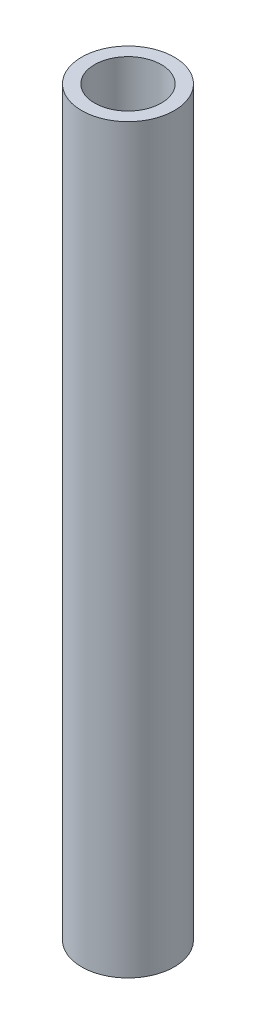
ISO-10303-21;
HEADER;
FILE_DESCRIPTION(('STEP AP214'),'2;1');
FILE_NAME('part.step','',(''),(''),'','','');
FILE_SCHEMA(('AUTOMOTIVE_DESIGN { 1 0 10303 214 1 1 1 1 }'));
ENDSEC;
DATA;
#1=APPLICATION_CONTEXT('core data for automotive mechanical design processes');
#2=APPLICATION_PROTOCOL_DEFINITION('international standard','automotive_design',2000,#1);
#3=PRODUCT_CONTEXT('',#1,'mechanical');
#4=PRODUCT('Part','Part','',(#3));
#5=PRODUCT_RELATED_PRODUCT_CATEGORY('part','',(#4));
#6=PRODUCT_DEFINITION_FORMATION('','',#4);
#7=PRODUCT_DEFINITION_CONTEXT('part definition',#1,'design');
#8=PRODUCT_DEFINITION('design','',#6,#7);
#9=PRODUCT_DEFINITION_SHAPE('','',#8);
#10=(LENGTH_UNIT() NAMED_UNIT(*) SI_UNIT(.MILLI.,.METRE.));
#11=(NAMED_UNIT(*) PLANE_ANGLE_UNIT() SI_UNIT($,.RADIAN.));
#12=(NAMED_UNIT(*) SI_UNIT($,.STERADIAN.) SOLID_ANGLE_UNIT());
#13=UNCERTAINTY_MEASURE_WITH_UNIT(LENGTH_MEASURE(1.E-05),#10,'distance_accuracy_value','');
#14=(GEOMETRIC_REPRESENTATION_CONTEXT(3) GLOBAL_UNCERTAINTY_ASSIGNED_CONTEXT((#13)) GLOBAL_UNIT_ASSIGNED_CONTEXT((#10,
#11,#12)) REPRESENTATION_CONTEXT('',''));
#15=CARTESIAN_POINT('',(0.,0.,0.));
#16=DIRECTION('',(0.,0.,1.));
#17=DIRECTION('',(1.,0.,0.));
#18=AXIS2_PLACEMENT_3D('',#15,#16,#17);
#19=CARTESIAN_POINT('',(0.,50.8,0.));
#20=DIRECTION('',(0.,1.,0.));
#21=DIRECTION('',(0.,0.,1.));
#22=AXIS2_PLACEMENT_3D('',#19,#20,#21);
#23=PLANE('',#22);
#24=CARTESIAN_POINT('',(0.,50.8,0.));
#25=DIRECTION('',(0.,1.,0.));
#26=DIRECTION('',(0.,0.,1.));
#27=AXIS2_PLACEMENT_3D('',#24,#25,#26);
#28=CIRCLE('',#27,3.175);
#29=CARTESIAN_POINT('',(0.,50.8,3.175));
#30=VERTEX_POINT('',#29);
#31=EDGE_CURVE('E10',#30,#30,#28,.T.);
#32=ORIENTED_EDGE('',*,*,#31,.T.);
#33=EDGE_LOOP('',(#32));
#34=FACE_BOUND('',#33,.T.);
#35=CARTESIAN_POINT('',(0.,50.8,0.));
#36=DIRECTION('',(0.,1.,0.));
#37=DIRECTION('',(0.,0.,1.));
#38=AXIS2_PLACEMENT_3D('',#35,#36,#37);
#39=CIRCLE('',#38,2.286);
#40=CARTESIAN_POINT('',(0.,50.8,2.286));
#41=VERTEX_POINT('',#40);
#42=EDGE_CURVE('E41',#41,#41,#39,.T.);
#43=ORIENTED_EDGE('',*,*,#42,.F.);
#44=EDGE_LOOP('',(#43));
#45=FACE_BOUND('',#44,.T.);
#46=ADVANCED_FACE('F30',(#34,#45),#23,.T.);
#47=CARTESIAN_POINT('',(0.,0.,0.));
#48=DIRECTION('',(0.,1.,0.));
#49=DIRECTION('',(0.,0.,1.));
#50=AXIS2_PLACEMENT_3D('',#47,#48,#49);
#51=PLANE('',#50);
#52=CARTESIAN_POINT('',(0.,0.,0.));
#53=DIRECTION('',(0.,1.,0.));
#54=DIRECTION('',(0.,0.,1.));
#55=AXIS2_PLACEMENT_3D('',#52,#53,#54);
#56=CIRCLE('',#55,3.175);
#57=CARTESIAN_POINT('',(0.,0.,3.175));
#58=VERTEX_POINT('',#57);
#59=EDGE_CURVE('E34',#58,#58,#56,.T.);
#60=ORIENTED_EDGE('',*,*,#59,.F.);
#61=EDGE_LOOP('',(#60));
#62=FACE_BOUND('',#61,.T.);
#63=CARTESIAN_POINT('',(0.,0.,0.));
#64=DIRECTION('',(0.,1.,0.));
#65=DIRECTION('',(0.,0.,1.));
#66=AXIS2_PLACEMENT_3D('',#63,#64,#65);
#67=CIRCLE('',#66,2.286);
#68=CARTESIAN_POINT('',(0.,0.,2.286));
#69=VERTEX_POINT('',#68);
#70=EDGE_CURVE('E43',#69,#69,#67,.T.);
#71=ORIENTED_EDGE('',*,*,#70,.T.);
#72=EDGE_LOOP('',(#71));
#73=FACE_BOUND('',#72,.T.);
#74=ADVANCED_FACE('F53',(#62,#73),#51,.F.);
#75=CARTESIAN_POINT('',(0.,50.8,0.));
#76=DIRECTION('',(0.,-1.,0.));
#77=DIRECTION('',(0.,0.,-1.));
#78=AXIS2_PLACEMENT_3D('',#75,#76,#77);
#79=CYLINDRICAL_SURFACE('',#78,3.175);
#80=ORIENTED_EDGE('',*,*,#31,.F.);
#81=EDGE_LOOP('',(#80));
#82=FACE_BOUND('',#81,.T.);
#83=ORIENTED_EDGE('',*,*,#59,.T.);
#84=EDGE_LOOP('',(#83));
#85=FACE_BOUND('',#84,.T.);
#86=ADVANCED_FACE('F32',(#82,#85),#79,.T.);
#87=CARTESIAN_POINT('',(0.,50.8,0.));
#88=DIRECTION('',(0.,-1.,0.));
#89=DIRECTION('',(0.,0.,-1.));
#90=AXIS2_PLACEMENT_3D('',#87,#88,#89);
#91=CYLINDRICAL_SURFACE('',#90,2.286);
#92=ORIENTED_EDGE('',*,*,#42,.T.);
#93=EDGE_LOOP('',(#92));
#94=FACE_BOUND('',#93,.T.);
#95=ORIENTED_EDGE('',*,*,#70,.F.);
#96=EDGE_LOOP('',(#95));
#97=FACE_BOUND('',#96,.T.);
#98=ADVANCED_FACE('F49',(#94,#97),#91,.F.);
#99=CLOSED_SHELL('',(#46,#74,#86,#98));
#100=MANIFOLD_SOLID_BREP('B2',#99);
#101=ADVANCED_BREP_SHAPE_REPRESENTATION('',(#18,#100),#14);
#102=SHAPE_DEFINITION_REPRESENTATION(#9,#101);
ENDSEC;
END-ISO-10303-21;
